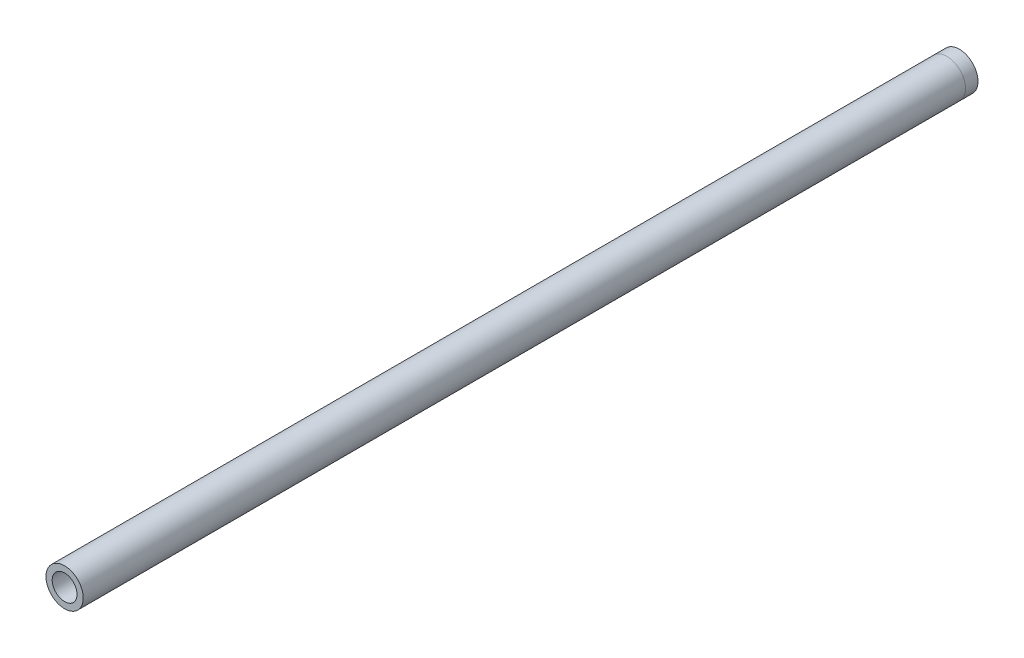
ISO-10303-21;
HEADER;
FILE_DESCRIPTION(('STEP AP214'),'2;1');
FILE_NAME('part.step','',(''),(''),'','','');
FILE_SCHEMA(('AUTOMOTIVE_DESIGN { 1 0 10303 214 1 1 1 1 }'));
ENDSEC;
DATA;
#1=APPLICATION_CONTEXT('core data for automotive mechanical design processes');
#2=APPLICATION_PROTOCOL_DEFINITION('international standard','automotive_design',2000,#1);
#3=PRODUCT_CONTEXT('',#1,'mechanical');
#4=PRODUCT('Part','Part','',(#3));
#5=PRODUCT_RELATED_PRODUCT_CATEGORY('part','',(#4));
#6=PRODUCT_DEFINITION_FORMATION('','',#4);
#7=PRODUCT_DEFINITION_CONTEXT('part definition',#1,'design');
#8=PRODUCT_DEFINITION('design','',#6,#7);
#9=PRODUCT_DEFINITION_SHAPE('','',#8);
#10=(LENGTH_UNIT() NAMED_UNIT(*) SI_UNIT(.MILLI.,.METRE.));
#11=(NAMED_UNIT(*) PLANE_ANGLE_UNIT() SI_UNIT($,.RADIAN.));
#12=(NAMED_UNIT(*) SI_UNIT($,.STERADIAN.) SOLID_ANGLE_UNIT());
#13=UNCERTAINTY_MEASURE_WITH_UNIT(LENGTH_MEASURE(1.E-05),#10,'distance_accuracy_value','');
#14=(GEOMETRIC_REPRESENTATION_CONTEXT(3) GLOBAL_UNCERTAINTY_ASSIGNED_CONTEXT((#13)) GLOBAL_UNIT_ASSIGNED_CONTEXT((#10,
#11,#12)) REPRESENTATION_CONTEXT('',''));
#15=CARTESIAN_POINT('',(0.,0.,0.));
#16=DIRECTION('',(0.,0.,1.));
#17=DIRECTION('',(1.,0.,0.));
#18=AXIS2_PLACEMENT_3D('',#15,#16,#17);
#19=CARTESIAN_POINT('',(74.,0.,457.2));
#20=DIRECTION('',(0.,0.,-1.));
#21=DIRECTION('',(-1.,0.,0.));
#22=AXIS2_PLACEMENT_3D('',#19,#20,#21);
#23=CYLINDRICAL_SURFACE('',#22,9.52500000000001);
#24=CARTESIAN_POINT('',(74.,0.,457.2));
#25=DIRECTION('',(0.,0.,1.));
#26=DIRECTION('',(1.,0.,0.));
#27=AXIS2_PLACEMENT_3D('',#24,#25,#26);
#28=CIRCLE('',#27,9.52500000000001);
#29=CARTESIAN_POINT('',(83.525,0.,457.2));
#30=VERTEX_POINT('',#29);
#31=EDGE_CURVE('E41',#30,#30,#28,.T.);
#32=ORIENTED_EDGE('',*,*,#31,.F.);
#33=EDGE_LOOP('',(#32));
#34=FACE_BOUND('',#33,.T.);
#35=CARTESIAN_POINT('',(74.,0.,6.35000000000002));
#36=DIRECTION('',(0.,0.,1.));
#37=DIRECTION('',(1.,0.,0.));
#38=AXIS2_PLACEMENT_3D('',#35,#36,#37);
#39=CIRCLE('',#38,9.52500000000001);
#40=CARTESIAN_POINT('',(83.525,0.,6.35000000000002));
#41=VERTEX_POINT('',#40);
#42=EDGE_CURVE('E10',#41,#41,#39,.T.);
#43=ORIENTED_EDGE('',*,*,#42,.T.);
#44=EDGE_LOOP('',(#43));
#45=FACE_BOUND('',#44,.T.);
#46=ADVANCED_FACE('F34',(#34,#45),#23,.T.);
#47=CARTESIAN_POINT('',(74.,0.,457.2));
#48=DIRECTION('',(0.,0.,-1.));
#49=DIRECTION('',(-1.,0.,0.));
#50=AXIS2_PLACEMENT_3D('',#47,#48,#49);
#51=CYLINDRICAL_SURFACE('',#50,6.35);
#52=CARTESIAN_POINT('',(74.,0.,457.2));
#53=DIRECTION('',(0.,0.,1.));
#54=DIRECTION('',(1.,0.,0.));
#55=AXIS2_PLACEMENT_3D('',#52,#53,#54);
#56=CIRCLE('',#55,6.35);
#57=CARTESIAN_POINT('',(80.35,0.,457.2));
#58=VERTEX_POINT('',#57);
#59=EDGE_CURVE('E45',#58,#58,#56,.T.);
#60=ORIENTED_EDGE('',*,*,#59,.T.);
#61=EDGE_LOOP('',(#60));
#62=FACE_BOUND('',#61,.T.);
#63=CARTESIAN_POINT('',(74.,0.,0.));
#64=DIRECTION('',(0.,0.,1.));
#65=DIRECTION('',(1.,0.,0.));
#66=AXIS2_PLACEMENT_3D('',#63,#64,#65);
#67=CIRCLE('',#66,6.35);
#68=CARTESIAN_POINT('',(80.35,0.,0.));
#69=VERTEX_POINT('',#68);
#70=EDGE_CURVE('E53',#69,#69,#67,.T.);
#71=ORIENTED_EDGE('',*,*,#70,.F.);
#72=EDGE_LOOP('',(#71));
#73=FACE_BOUND('',#72,.T.);
#74=ADVANCED_FACE('F36',(#62,#73),#51,.F.);
#75=ORIENTED_EDGE('',*,*,#42,.F.);
#76=EDGE_LOOP('',(#75));
#77=FACE_BOUND('',#76,.T.);
#78=CARTESIAN_POINT('',(74.,0.,0.));
#79=DIRECTION('',(0.,0.,1.));
#80=DIRECTION('',(1.,0.,0.));
#81=AXIS2_PLACEMENT_3D('',#78,#79,#80);
#82=CIRCLE('',#81,9.52500000000001);
#83=CARTESIAN_POINT('',(83.525,0.,0.));
#84=VERTEX_POINT('',#83);
#85=EDGE_CURVE('E50',#84,#84,#82,.T.);
#86=ORIENTED_EDGE('',*,*,#85,.T.);
#87=EDGE_LOOP('',(#86));
#88=FACE_BOUND('',#87,.T.);
#89=ADVANCED_FACE('F58',(#77,#88),#23,.T.);
#90=CARTESIAN_POINT('',(74.,0.,457.2));
#91=DIRECTION('',(0.,0.,1.));
#92=DIRECTION('',(1.,0.,0.));
#93=AXIS2_PLACEMENT_3D('',#90,#91,#92);
#94=PLANE('',#93);
#95=ORIENTED_EDGE('',*,*,#59,.F.);
#96=EDGE_LOOP('',(#95));
#97=FACE_BOUND('',#96,.T.);
#98=ORIENTED_EDGE('',*,*,#31,.T.);
#99=EDGE_LOOP('',(#98));
#100=FACE_BOUND('',#99,.T.);
#101=ADVANCED_FACE('F62',(#97,#100),#94,.T.);
#102=CARTESIAN_POINT('',(74.,0.,0.));
#103=DIRECTION('',(0.,0.,1.));
#104=DIRECTION('',(1.,0.,0.));
#105=AXIS2_PLACEMENT_3D('',#102,#103,#104);
#106=PLANE('',#105);
#107=ORIENTED_EDGE('',*,*,#70,.T.);
#108=EDGE_LOOP('',(#107));
#109=FACE_BOUND('',#108,.T.);
#110=ORIENTED_EDGE('',*,*,#85,.F.);
#111=EDGE_LOOP('',(#110));
#112=FACE_BOUND('',#111,.T.);
#113=ADVANCED_FACE('F60',(#109,#112),#106,.F.);
#114=CLOSED_SHELL('',(#46,#74,#89,#101,#113));
#115=MANIFOLD_SOLID_BREP('B2',#114);
#116=ADVANCED_BREP_SHAPE_REPRESENTATION('',(#18,#115),#14);
#117=SHAPE_DEFINITION_REPRESENTATION(#9,#116);
ENDSEC;
END-ISO-10303-21;
